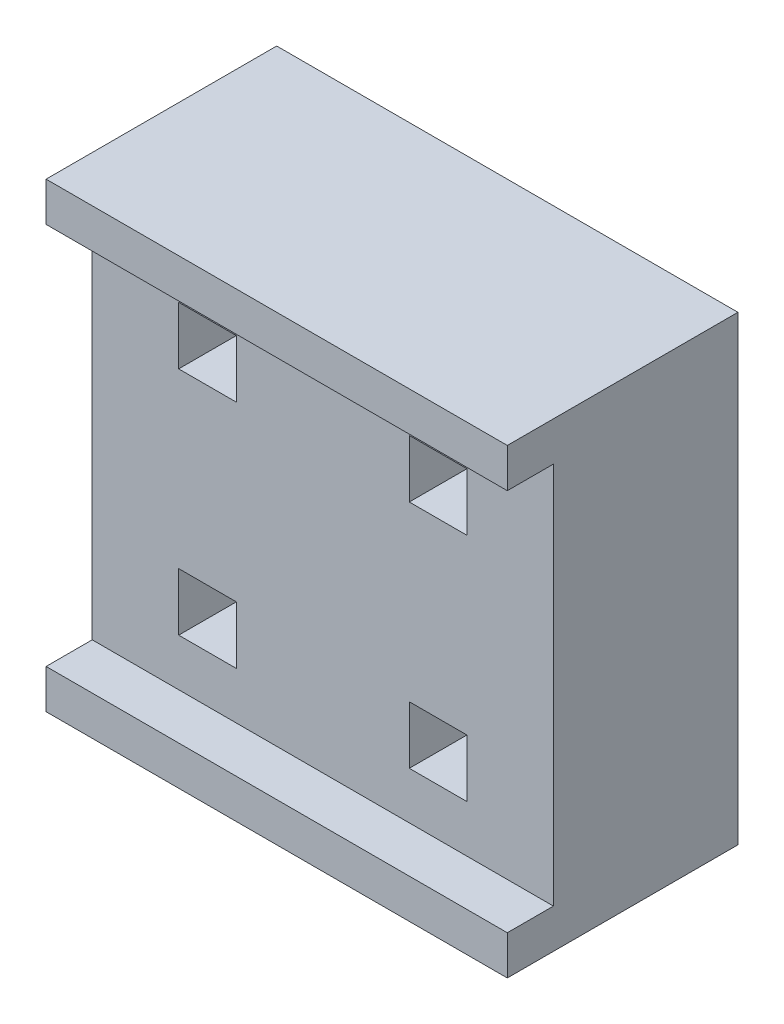
ISO-10303-21;
HEADER;
FILE_DESCRIPTION(('STEP AP214'),'2;1');
FILE_NAME('part.step','',(''),(''),'','','');
FILE_SCHEMA(('AUTOMOTIVE_DESIGN { 1 0 10303 214 1 1 1 1 }'));
ENDSEC;
DATA;
#1=APPLICATION_CONTEXT('core data for automotive mechanical design processes');
#2=APPLICATION_PROTOCOL_DEFINITION('international standard','automotive_design',2000,#1);
#3=PRODUCT_CONTEXT('',#1,'mechanical');
#4=PRODUCT('Part','Part','',(#3));
#5=PRODUCT_RELATED_PRODUCT_CATEGORY('part','',(#4));
#6=PRODUCT_DEFINITION_FORMATION('','',#4);
#7=PRODUCT_DEFINITION_CONTEXT('part definition',#1,'design');
#8=PRODUCT_DEFINITION('design','',#6,#7);
#9=PRODUCT_DEFINITION_SHAPE('','',#8);
#10=(LENGTH_UNIT() NAMED_UNIT(*) SI_UNIT(.MILLI.,.METRE.));
#11=(NAMED_UNIT(*) PLANE_ANGLE_UNIT() SI_UNIT($,.RADIAN.));
#12=(NAMED_UNIT(*) SI_UNIT($,.STERADIAN.) SOLID_ANGLE_UNIT());
#13=UNCERTAINTY_MEASURE_WITH_UNIT(LENGTH_MEASURE(1.E-05),#10,'distance_accuracy_value','');
#14=(GEOMETRIC_REPRESENTATION_CONTEXT(3) GLOBAL_UNCERTAINTY_ASSIGNED_CONTEXT((#13)) GLOBAL_UNIT_ASSIGNED_CONTEXT((#10,
#11,#12)) REPRESENTATION_CONTEXT('',''));
#15=CARTESIAN_POINT('',(0.,0.,0.));
#16=DIRECTION('',(0.,0.,1.));
#17=DIRECTION('',(1.,0.,0.));
#18=AXIS2_PLACEMENT_3D('',#15,#16,#17);
#19=CARTESIAN_POINT('',(0.000124023441458121,0.000123801387605624,6.33));
#20=DIRECTION('',(0.,-4.37113882867379E-08,1.));
#21=DIRECTION('',(0.,-1.,-4.37113882867379E-08));
#22=AXIS2_PLACEMENT_3D('',#19,#20,#21);
#23=PLANE('',#22);
#24=DIRECTION('',(1.,0.,0.));
#25=VECTOR('',#24,1.);
#26=CARTESIAN_POINT('',(-2.53987597655854,-2.10807619861239,6.32999990784765));
#27=LINE('',#26,#25);
#28=CARTESIAN_POINT('',(-2.53987597655854,-2.10807619861239,6.32999990784765));
#29=VERTEX_POINT('',#28);
#30=CARTESIAN_POINT('',(2.54012402344146,-2.10807619861239,6.32999990784765));
#31=VERTEX_POINT('',#30);
#32=EDGE_CURVE('E11',#29,#31,#27,.T.);
#33=ORIENTED_EDGE('',*,*,#32,.F.);
#34=DIRECTION('',(0.,-0.999999999999999,-4.37113882735736E-08));
#35=VECTOR('',#34,1.);
#36=CARTESIAN_POINT('',(-2.53987597655854,-2.1080761986124,6.32999990784765));
#37=LINE('',#36,#35);
#38=CARTESIAN_POINT('',(-2.53987597655854,-2.53987619861239,6.32999988897307));
#39=VERTEX_POINT('',#38);
#40=EDGE_CURVE('E368',#29,#39,#37,.T.);
#41=ORIENTED_EDGE('',*,*,#40,.T.);
#42=DIRECTION('',(1.,0.,0.));
#43=VECTOR('',#42,1.);
#44=CARTESIAN_POINT('',(-2.53987597655854,-2.53987619861239,6.32999988897307));
#45=LINE('',#44,#43);
#46=CARTESIAN_POINT('',(2.54012402344146,-2.53987619861239,6.32999988897307));
#47=VERTEX_POINT('',#46);
#48=EDGE_CURVE('E366',#39,#47,#45,.T.);
#49=ORIENTED_EDGE('',*,*,#48,.T.);
#50=DIRECTION('',(0.,0.999999999999999,4.37113882735736E-08));
#51=VECTOR('',#50,1.);
#52=CARTESIAN_POINT('',(2.54012402344146,-2.53987619861239,6.32999988897307));
#53=LINE('',#52,#51);
#54=EDGE_CURVE('E354',#47,#31,#53,.T.);
#55=ORIENTED_EDGE('',*,*,#54,.T.);
#56=EDGE_LOOP('',(#33,#41,#49,#55));
#57=FACE_BOUND('',#56,.T.);
#58=ADVANCED_FACE('F17',(#57),#23,.T.);
#59=CARTESIAN_POINT('',(-2.53987597655854,2.54012391241453,3.79000011102693));
#60=DIRECTION('',(-1.,0.,0.));
#61=DIRECTION('',(0.,-1.,-4.37113882867379E-08));
#62=AXIS2_PLACEMENT_3D('',#59,#60,#61);
#63=PLANE('',#62);
#64=DIRECTION('',(0.,4.37113897134182E-08,-0.999999999999999));
#65=VECTOR('',#64,1.);
#66=CARTESIAN_POINT('',(-2.53987597655854,-2.10807619861239,6.32999990784765));
#67=LINE('',#66,#65);
#68=CARTESIAN_POINT('',(-2.53987597655854,-2.10807617640701,5.82199990784765));
#69=VERTEX_POINT('',#68);
#70=EDGE_CURVE('E24',#29,#69,#67,.T.);
#71=ORIENTED_EDGE('',*,*,#70,.T.);
#72=DIRECTION('',(0.,0.999999999999999,4.37113881124894E-08));
#73=VECTOR('',#72,1.);
#74=CARTESIAN_POINT('',(-2.53987597655854,-2.10807617640701,5.82199990784765));
#75=LINE('',#74,#73);
#76=CARTESIAN_POINT('',(-2.53987597655854,2.10832382359299,5.82200009215235));
#77=VERTEX_POINT('',#76);
#78=EDGE_CURVE('E364',#69,#77,#75,.T.);
#79=ORIENTED_EDGE('',*,*,#78,.T.);
#80=DIRECTION('',(0.,-4.37113888392268E-08,0.999999999999999));
#81=VECTOR('',#80,1.);
#82=CARTESIAN_POINT('',(-2.53987597655854,2.10832382359299,5.82200009215235));
#83=LINE('',#82,#81);
#84=CARTESIAN_POINT('',(-2.53987597655854,2.10832380138761,6.33000009215235));
#85=VERTEX_POINT('',#84);
#86=EDGE_CURVE('E356',#77,#85,#83,.T.);
#87=ORIENTED_EDGE('',*,*,#86,.T.);
#88=DIRECTION('',(0.,-0.999999999999999,-4.37113882735736E-08));
#89=VECTOR('',#88,1.);
#90=CARTESIAN_POINT('',(-2.53987597655854,2.54012380138761,6.33000011102693));
#91=LINE('',#90,#89);
#92=CARTESIAN_POINT('',(-2.53987597655854,2.54012380138761,6.33000011102693));
#93=VERTEX_POINT('',#92);
#94=EDGE_CURVE('E347',#93,#85,#91,.T.);
#95=ORIENTED_EDGE('',*,*,#94,.F.);
#96=DIRECTION('',(0.,-4.3711388314712E-08,0.999999999999999));
#97=VECTOR('',#96,1.);
#98=CARTESIAN_POINT('',(-2.53987597655854,2.54012391241453,3.79000011102693));
#99=LINE('',#98,#97);
#100=CARTESIAN_POINT('',(-2.53987597655854,2.54012391241453,3.79000011102693));
#101=VERTEX_POINT('',#100);
#102=EDGE_CURVE('E337',#101,#93,#99,.T.);
#103=ORIENTED_EDGE('',*,*,#102,.F.);
#104=DIRECTION('',(0.,-0.999999999999999,-4.37113884895503E-08));
#105=VECTOR('',#104,1.);
#106=CARTESIAN_POINT('',(-2.53987597655854,2.54012391241453,3.79000011102693));
#107=LINE('',#106,#105);
#108=CARTESIAN_POINT('',(-2.53987597655854,-2.53987608758547,3.78999988897307));
#109=VERTEX_POINT('',#108);
#110=EDGE_CURVE('E324',#101,#109,#107,.T.);
#111=ORIENTED_EDGE('',*,*,#110,.T.);
#112=DIRECTION('',(0.,-4.3711388314712E-08,0.999999999999999));
#113=VECTOR('',#112,1.);
#114=CARTESIAN_POINT('',(-2.53987597655854,-2.53987608758547,3.78999988897307));
#115=LINE('',#114,#113);
#116=EDGE_CURVE('E358',#109,#39,#115,.T.);
#117=ORIENTED_EDGE('',*,*,#116,.T.);
#118=ORIENTED_EDGE('',*,*,#40,.F.);
#119=EDGE_LOOP('',(#71,#79,#87,#95,#103,#111,#117,#118));
#120=FACE_BOUND('',#119,.T.);
#121=ADVANCED_FACE('F374',(#120),#63,.T.);
#122=CARTESIAN_POINT('',(-2.53987597655854,-2.53987608758547,3.78999988897307));
#123=DIRECTION('',(0.,-1.,-4.37113882867379E-08));
#124=DIRECTION('',(1.,0.,0.));
#125=AXIS2_PLACEMENT_3D('',#122,#123,#124);
#126=PLANE('',#125);
#127=ORIENTED_EDGE('',*,*,#48,.F.);
#128=ORIENTED_EDGE('',*,*,#116,.F.);
#129=DIRECTION('',(1.,0.,0.));
#130=VECTOR('',#129,1.);
#131=CARTESIAN_POINT('',(-2.53987597655854,-2.53987608758547,3.78999988897307));
#132=LINE('',#131,#130);
#133=CARTESIAN_POINT('',(2.54012402344146,-2.53987608758547,3.78999988897307));
#134=VERTEX_POINT('',#133);
#135=EDGE_CURVE('E350',#109,#134,#132,.T.);
#136=ORIENTED_EDGE('',*,*,#135,.T.);
#137=DIRECTION('',(0.,-4.3711388314712E-08,0.999999999999999));
#138=VECTOR('',#137,1.);
#139=CARTESIAN_POINT('',(2.54012402344146,-2.53987608758547,3.78999988897307));
#140=LINE('',#139,#138);
#141=EDGE_CURVE('E340',#134,#47,#140,.T.);
#142=ORIENTED_EDGE('',*,*,#141,.T.);
#143=EDGE_LOOP('',(#127,#128,#136,#142));
#144=FACE_BOUND('',#143,.T.);
#145=ADVANCED_FACE('F372',(#144),#126,.T.);
#146=CARTESIAN_POINT('',(2.54012402344146,-2.53987608758547,3.78999988897307));
#147=DIRECTION('',(1.,0.,0.));
#148=DIRECTION('',(0.,1.,4.37113882867379E-08));
#149=AXIS2_PLACEMENT_3D('',#146,#147,#148);
#150=PLANE('',#149);
#151=DIRECTION('',(0.,4.37113897134182E-08,-0.999999999999999));
#152=VECTOR('',#151,1.);
#153=CARTESIAN_POINT('',(2.54012402344146,-2.10807619861239,6.32999990784765));
#154=LINE('',#153,#152);
#155=CARTESIAN_POINT('',(2.54012402344146,-2.10807617640701,5.82199990784765));
#156=VERTEX_POINT('',#155);
#157=EDGE_CURVE('E361',#31,#156,#154,.T.);
#158=ORIENTED_EDGE('',*,*,#157,.F.);
#159=ORIENTED_EDGE('',*,*,#54,.F.);
#160=ORIENTED_EDGE('',*,*,#141,.F.);
#161=DIRECTION('',(0.,0.999999999999999,4.37113881398737E-08));
#162=VECTOR('',#161,1.);
#163=CARTESIAN_POINT('',(2.54012402344146,-2.53987608758547,3.78999988897307));
#164=LINE('',#163,#162);
#165=CARTESIAN_POINT('',(2.54012402344146,2.54012391241453,3.79000011102693));
#166=VERTEX_POINT('',#165);
#167=EDGE_CURVE('E327',#134,#166,#164,.T.);
#168=ORIENTED_EDGE('',*,*,#167,.T.);
#169=DIRECTION('',(0.,-4.3711388314712E-08,0.999999999999999));
#170=VECTOR('',#169,1.);
#171=CARTESIAN_POINT('',(2.54012402344146,2.54012391241453,3.79000011102693));
#172=LINE('',#171,#170);
#173=CARTESIAN_POINT('',(2.54012402344146,2.54012380138761,6.33000011102693));
#174=VERTEX_POINT('',#173);
#175=EDGE_CURVE('E314',#166,#174,#172,.T.);
#176=ORIENTED_EDGE('',*,*,#175,.T.);
#177=DIRECTION('',(0.,0.999999999999999,4.37113882735736E-08));
#178=VECTOR('',#177,1.);
#179=CARTESIAN_POINT('',(2.54012402344146,2.10832380138761,6.33000009215235));
#180=LINE('',#179,#178);
#181=CARTESIAN_POINT('',(2.54012402344146,2.10832380138761,6.33000009215235));
#182=VERTEX_POINT('',#181);
#183=EDGE_CURVE('E304',#182,#174,#180,.T.);
#184=ORIENTED_EDGE('',*,*,#183,.F.);
#185=DIRECTION('',(0.,-4.37113888392268E-08,0.999999999999999));
#186=VECTOR('',#185,1.);
#187=CARTESIAN_POINT('',(2.54012402344146,2.10832382359299,5.82200009215235));
#188=LINE('',#187,#186);
#189=CARTESIAN_POINT('',(2.54012402344146,2.10832382359299,5.82200009215235));
#190=VERTEX_POINT('',#189);
#191=EDGE_CURVE('E290',#190,#182,#188,.T.);
#192=ORIENTED_EDGE('',*,*,#191,.F.);
#193=DIRECTION('',(0.,0.999999999999999,4.37113881124894E-08));
#194=VECTOR('',#193,1.);
#195=CARTESIAN_POINT('',(2.54012402344146,-2.10807617640701,5.82199990784765));
#196=LINE('',#195,#194);
#197=EDGE_CURVE('E279',#156,#190,#196,.T.);
#198=ORIENTED_EDGE('',*,*,#197,.F.);
#199=EDGE_LOOP('',(#158,#159,#160,#168,#176,#184,#192,#198));
#200=FACE_BOUND('',#199,.T.);
#201=ADVANCED_FACE('F382',(#200),#150,.T.);
#202=CARTESIAN_POINT('',(0.952624023441458,1.58762391241453,3.79000006939183));
#203=DIRECTION('',(-1.,0.,0.));
#204=DIRECTION('',(0.,-1.,-4.37113882867379E-08));
#205=AXIS2_PLACEMENT_3D('',#202,#203,#204);
#206=PLANE('',#205);
#207=DIRECTION('',(0.,-4.37113881835833E-08,0.999999999999999));
#208=VECTOR('',#207,1.);
#209=CARTESIAN_POINT('',(0.952624023441458,1.58762391241453,3.79000006939183));
#210=LINE('',#209,#208);
#211=CARTESIAN_POINT('',(0.952624023441458,1.58762391241453,3.79000006939183));
#212=VERTEX_POINT('',#211);
#213=CARTESIAN_POINT('',(0.952624023441458,1.58762382359299,5.82200006939183));
#214=VERTEX_POINT('',#213);
#215=EDGE_CURVE('E352',#212,#214,#210,.T.);
#216=ORIENTED_EDGE('',*,*,#215,.T.);
#217=DIRECTION('',(0.,-0.999999999999999,-4.37113890140651E-08));
#218=VECTOR('',#217,1.);
#219=CARTESIAN_POINT('',(0.952624023441458,1.58762382359299,5.82200006939183));
#220=LINE('',#219,#218);
#221=CARTESIAN_POINT('',(0.952624023441458,0.952623823592991,5.8220000416351));
#222=VERTEX_POINT('',#221);
#223=EDGE_CURVE('E343',#214,#222,#220,.T.);
#224=ORIENTED_EDGE('',*,*,#223,.T.);
#225=DIRECTION('',(0.,-4.37113882928572E-08,0.999999999999999));
#226=VECTOR('',#225,1.);
#227=CARTESIAN_POINT('',(0.952624023441458,0.952623912414532,3.7900000416351));
#228=LINE('',#227,#226);
#229=CARTESIAN_POINT('',(0.952624023441458,0.952623912414532,3.7900000416351));
#230=VERTEX_POINT('',#229);
#231=EDGE_CURVE('E329',#230,#222,#228,.T.);
#232=ORIENTED_EDGE('',*,*,#231,.F.);
#233=DIRECTION('',(0.,-0.999999999999999,-4.3711388314712E-08));
#234=VECTOR('',#233,1.);
#235=CARTESIAN_POINT('',(0.952624023441458,1.58762391241453,3.79000006939183));
#236=LINE('',#235,#234);
#237=EDGE_CURVE('E316',#212,#230,#236,.T.);
#238=ORIENTED_EDGE('',*,*,#237,.F.);
#239=EDGE_LOOP('',(#216,#224,#232,#238));
#240=FACE_BOUND('',#239,.T.);
#241=ADVANCED_FACE('F426',(#240),#206,.F.);
#242=CARTESIAN_POINT('',(1.58762402344146,1.58762391241453,3.79000006939183));
#243=DIRECTION('',(0.,1.,4.37113882867379E-08));
#244=DIRECTION('',(-1.,0.,0.));
#245=AXIS2_PLACEMENT_3D('',#242,#243,#244);
#246=PLANE('',#245);
#247=DIRECTION('',(0.,-4.37113881835833E-08,0.999999999999999));
#248=VECTOR('',#247,1.);
#249=CARTESIAN_POINT('',(1.58762402344146,1.58762391241453,3.79000006939183));
#250=LINE('',#249,#248);
#251=CARTESIAN_POINT('',(1.58762402344146,1.58762391241453,3.79000006939183));
#252=VERTEX_POINT('',#251);
#253=CARTESIAN_POINT('',(1.58762402344146,1.58762382359299,5.82200006939183));
#254=VERTEX_POINT('',#253);
#255=EDGE_CURVE('E345',#252,#254,#250,.T.);
#256=ORIENTED_EDGE('',*,*,#255,.T.);
#257=DIRECTION('',(-1.,0.,0.));
#258=VECTOR('',#257,1.);
#259=CARTESIAN_POINT('',(1.58762402344146,1.58762382359299,5.82200006939183));
#260=LINE('',#259,#258);
#261=EDGE_CURVE('E332',#254,#214,#260,.T.);
#262=ORIENTED_EDGE('',*,*,#261,.T.);
#263=ORIENTED_EDGE('',*,*,#215,.F.);
#264=DIRECTION('',(-1.,0.,0.));
#265=VECTOR('',#264,1.);
#266=CARTESIAN_POINT('',(1.58762402344146,1.58762391241453,3.79000006939183));
#267=LINE('',#266,#265);
#268=EDGE_CURVE('E307',#252,#212,#267,.T.);
#269=ORIENTED_EDGE('',*,*,#268,.F.);
#270=EDGE_LOOP('',(#256,#262,#263,#269));
#271=FACE_BOUND('',#270,.T.);
#272=ADVANCED_FACE('F431',(#271),#246,.F.);
#273=CARTESIAN_POINT('',(1.58762402344146,0.952623912414532,3.7900000416351));
#274=DIRECTION('',(1.,0.,0.));
#275=DIRECTION('',(0.,1.,4.37113882867379E-08));
#276=AXIS2_PLACEMENT_3D('',#273,#274,#275);
#277=PLANE('',#276);
#278=DIRECTION('',(0.,-4.37113882928572E-08,0.999999999999999));
#279=VECTOR('',#278,1.);
#280=CARTESIAN_POINT('',(1.58762402344146,0.952623912414532,3.7900000416351));
#281=LINE('',#280,#279);
#282=CARTESIAN_POINT('',(1.58762402344146,0.952623912414532,3.7900000416351));
#283=VERTEX_POINT('',#282);
#284=CARTESIAN_POINT('',(1.58762402344146,0.952623823592991,5.8220000416351));
#285=VERTEX_POINT('',#284);
#286=EDGE_CURVE('E335',#283,#285,#281,.T.);
#287=ORIENTED_EDGE('',*,*,#286,.T.);
#288=DIRECTION('',(0.,0.999999999999999,4.37113890140651E-08));
#289=VECTOR('',#288,1.);
#290=CARTESIAN_POINT('',(1.58762402344146,0.952623823592991,5.8220000416351));
#291=LINE('',#290,#289);
#292=EDGE_CURVE('E319',#285,#254,#291,.T.);
#293=ORIENTED_EDGE('',*,*,#292,.T.);
#294=ORIENTED_EDGE('',*,*,#255,.F.);
#295=DIRECTION('',(0.,0.999999999999999,4.3711388314712E-08));
#296=VECTOR('',#295,1.);
#297=CARTESIAN_POINT('',(1.58762402344146,0.952623912414532,3.7900000416351));
#298=LINE('',#297,#296);
#299=EDGE_CURVE('E293',#283,#252,#298,.T.);
#300=ORIENTED_EDGE('',*,*,#299,.F.);
#301=EDGE_LOOP('',(#287,#293,#294,#300));
#302=FACE_BOUND('',#301,.T.);
#303=ADVANCED_FACE('F436',(#302),#277,.F.);
#304=CARTESIAN_POINT('',(0.952624023441458,-0.952376087585468,3.7899999583649));
#305=DIRECTION('',(-1.,0.,0.));
#306=DIRECTION('',(0.,-1.,-4.37113882867379E-08));
#307=AXIS2_PLACEMENT_3D('',#304,#305,#306);
#308=PLANE('',#307);
#309=DIRECTION('',(0.,-4.37113882928572E-08,0.999999999999999));
#310=VECTOR('',#309,1.);
#311=CARTESIAN_POINT('',(0.952624023441458,-0.952376087585468,3.7899999583649));
#312=LINE('',#311,#310);
#313=CARTESIAN_POINT('',(0.952624023441458,-0.952376087585468,3.7899999583649));
#314=VERTEX_POINT('',#313);
#315=CARTESIAN_POINT('',(0.952624023441458,-0.952376176407009,5.8219999583649));
#316=VERTEX_POINT('',#315);
#317=EDGE_CURVE('E322',#314,#316,#312,.T.);
#318=ORIENTED_EDGE('',*,*,#317,.T.);
#319=DIRECTION('',(0.,-0.999999999999999,-4.37113890140651E-08));
#320=VECTOR('',#319,1.);
#321=CARTESIAN_POINT('',(0.952624023441458,-0.952376176407009,5.8219999583649));
#322=LINE('',#321,#320);
#323=CARTESIAN_POINT('',(0.952624023441458,-1.58737617640701,5.82199993060817));
#324=VERTEX_POINT('',#323);
#325=EDGE_CURVE('E310',#316,#324,#322,.T.);
#326=ORIENTED_EDGE('',*,*,#325,.T.);
#327=DIRECTION('',(0.,-4.37113884021311E-08,0.999999999999999));
#328=VECTOR('',#327,1.);
#329=CARTESIAN_POINT('',(0.952624023441458,-1.58737608758547,3.78999993060817));
#330=LINE('',#329,#328);
#331=CARTESIAN_POINT('',(0.952624023441458,-1.58737608758547,3.78999993060817));
#332=VERTEX_POINT('',#331);
#333=EDGE_CURVE('E296',#332,#324,#330,.T.);
#334=ORIENTED_EDGE('',*,*,#333,.F.);
#335=DIRECTION('',(0.,-0.999999999999999,-4.3711388314712E-08));
#336=VECTOR('',#335,1.);
#337=CARTESIAN_POINT('',(0.952624023441458,-0.952376087585468,3.7899999583649));
#338=LINE('',#337,#336);
#339=EDGE_CURVE('E282',#314,#332,#338,.T.);
#340=ORIENTED_EDGE('',*,*,#339,.F.);
#341=EDGE_LOOP('',(#318,#326,#334,#340));
#342=FACE_BOUND('',#341,.T.);
#343=ADVANCED_FACE('F441',(#342),#308,.F.);
#344=CARTESIAN_POINT('',(1.58762402344146,-0.952376087585468,3.7899999583649));
#345=DIRECTION('',(0.,1.,4.37113882867379E-08));
#346=DIRECTION('',(-1.,0.,0.));
#347=AXIS2_PLACEMENT_3D('',#344,#345,#346);
#348=PLANE('',#347);
#349=DIRECTION('',(0.,-4.37113882928572E-08,0.999999999999999));
#350=VECTOR('',#349,1.);
#351=CARTESIAN_POINT('',(1.58762402344146,-0.952376087585468,3.7899999583649));
#352=LINE('',#351,#350);
#353=CARTESIAN_POINT('',(1.58762402344146,-0.952376087585468,3.7899999583649));
#354=VERTEX_POINT('',#353);
#355=CARTESIAN_POINT('',(1.58762402344146,-0.952376176407009,5.8219999583649));
#356=VERTEX_POINT('',#355);
#357=EDGE_CURVE('E312',#354,#356,#352,.T.);
#358=ORIENTED_EDGE('',*,*,#357,.T.);
#359=DIRECTION('',(-1.,0.,0.));
#360=VECTOR('',#359,1.);
#361=CARTESIAN_POINT('',(1.58762402344146,-0.952376176407009,5.8219999583649));
#362=LINE('',#361,#360);
#363=EDGE_CURVE('E299',#356,#316,#362,.T.);
#364=ORIENTED_EDGE('',*,*,#363,.T.);
#365=ORIENTED_EDGE('',*,*,#317,.F.);
#366=DIRECTION('',(-1.,0.,0.));
#367=VECTOR('',#366,1.);
#368=CARTESIAN_POINT('',(1.58762402344146,-0.952376087585468,3.7899999583649));
#369=LINE('',#368,#367);
#370=EDGE_CURVE('E272',#354,#314,#369,.T.);
#371=ORIENTED_EDGE('',*,*,#370,.F.);
#372=EDGE_LOOP('',(#358,#364,#365,#371));
#373=FACE_BOUND('',#372,.T.);
#374=ADVANCED_FACE('F446',(#373),#348,.F.);
#375=CARTESIAN_POINT('',(1.58762402344146,-1.58737608758547,3.78999993060817));
#376=DIRECTION('',(1.,0.,0.));
#377=DIRECTION('',(0.,1.,4.37113882867379E-08));
#378=AXIS2_PLACEMENT_3D('',#375,#376,#377);
#379=PLANE('',#378);
#380=DIRECTION('',(0.,-4.37113884021311E-08,0.999999999999999));
#381=VECTOR('',#380,1.);
#382=CARTESIAN_POINT('',(1.58762402344146,-1.58737608758547,3.78999993060817));
#383=LINE('',#382,#381);
#384=CARTESIAN_POINT('',(1.58762402344146,-1.58737608758547,3.78999993060817));
#385=VERTEX_POINT('',#384);
#386=CARTESIAN_POINT('',(1.58762402344146,-1.58737617640701,5.82199993060817));
#387=VERTEX_POINT('',#386);
#388=EDGE_CURVE('E302',#385,#387,#383,.T.);
#389=ORIENTED_EDGE('',*,*,#388,.T.);
#390=DIRECTION('',(0.,0.999999999999999,4.37113890140651E-08));
#391=VECTOR('',#390,1.);
#392=CARTESIAN_POINT('',(1.58762402344146,-1.58737617640701,5.82199993060817));
#393=LINE('',#392,#391);
#394=EDGE_CURVE('E285',#387,#356,#393,.T.);
#395=ORIENTED_EDGE('',*,*,#394,.T.);
#396=ORIENTED_EDGE('',*,*,#357,.F.);
#397=DIRECTION('',(0.,0.999999999999999,4.3711388314712E-08));
#398=VECTOR('',#397,1.);
#399=CARTESIAN_POINT('',(1.58762402344146,-1.58737608758547,3.78999993060817));
#400=LINE('',#399,#398);
#401=EDGE_CURVE('E261',#385,#354,#400,.T.);
#402=ORIENTED_EDGE('',*,*,#401,.F.);
#403=EDGE_LOOP('',(#389,#395,#396,#402));
#404=FACE_BOUND('',#403,.T.);
#405=ADVANCED_FACE('F474',(#404),#379,.F.);
#406=CARTESIAN_POINT('',(-1.58737597655854,1.58762391241453,3.79000006939183));
#407=DIRECTION('',(-1.,0.,0.));
#408=DIRECTION('',(0.,-1.,-4.37113882867379E-08));
#409=AXIS2_PLACEMENT_3D('',#406,#407,#408);
#410=PLANE('',#409);
#411=DIRECTION('',(0.,-4.37113881835833E-08,0.999999999999999));
#412=VECTOR('',#411,1.);
#413=CARTESIAN_POINT('',(-1.58737597655854,1.58762391241453,3.79000006939183));
#414=LINE('',#413,#412);
#415=CARTESIAN_POINT('',(-1.58737597655854,1.58762391241453,3.79000006939183));
#416=VERTEX_POINT('',#415);
#417=CARTESIAN_POINT('',(-1.58737597655854,1.58762382359299,5.82200006939183));
#418=VERTEX_POINT('',#417);
#419=EDGE_CURVE('E288',#416,#418,#414,.T.);
#420=ORIENTED_EDGE('',*,*,#419,.T.);
#421=DIRECTION('',(0.,-0.999999999999999,-4.37113890140651E-08));
#422=VECTOR('',#421,1.);
#423=CARTESIAN_POINT('',(-1.58737597655854,1.58762382359299,5.82200006939183));
#424=LINE('',#423,#422);
#425=CARTESIAN_POINT('',(-1.58737597655854,0.952623823592991,5.8220000416351));
#426=VERTEX_POINT('',#425);
#427=EDGE_CURVE('E275',#418,#426,#424,.T.);
#428=ORIENTED_EDGE('',*,*,#427,.T.);
#429=DIRECTION('',(0.,-4.37113882928572E-08,0.999999999999999));
#430=VECTOR('',#429,1.);
#431=CARTESIAN_POINT('',(-1.58737597655854,0.952623912414532,3.7900000416351));
#432=LINE('',#431,#430);
#433=CARTESIAN_POINT('',(-1.58737597655854,0.952623912414532,3.7900000416351));
#434=VERTEX_POINT('',#433);
#435=EDGE_CURVE('E264',#434,#426,#432,.T.);
#436=ORIENTED_EDGE('',*,*,#435,.F.);
#437=DIRECTION('',(0.,-0.999999999999999,-4.3711388314712E-08));
#438=VECTOR('',#437,1.);
#439=CARTESIAN_POINT('',(-1.58737597655854,1.58762391241453,3.79000006939183));
#440=LINE('',#439,#438);
#441=EDGE_CURVE('E253',#416,#434,#440,.T.);
#442=ORIENTED_EDGE('',*,*,#441,.F.);
#443=EDGE_LOOP('',(#420,#428,#436,#442));
#444=FACE_BOUND('',#443,.T.);
#445=ADVANCED_FACE('F478',(#444),#410,.F.);
#446=CARTESIAN_POINT('',(-0.952375976558542,1.58762391241453,3.79000006939183));
#447=DIRECTION('',(0.,1.,4.37113882867379E-08));
#448=DIRECTION('',(-1.,0.,0.));
#449=AXIS2_PLACEMENT_3D('',#446,#447,#448);
#450=PLANE('',#449);
#451=DIRECTION('',(0.,-4.37113881835833E-08,0.999999999999999));
#452=VECTOR('',#451,1.);
#453=CARTESIAN_POINT('',(-0.952375976558542,1.58762391241453,3.79000006939183));
#454=LINE('',#453,#452);
#455=CARTESIAN_POINT('',(-0.952375976558542,1.58762391241453,3.79000006939183));
#456=VERTEX_POINT('',#455);
#457=CARTESIAN_POINT('',(-0.952375976558542,1.58762382359299,5.82200006939183));
#458=VERTEX_POINT('',#457);
#459=EDGE_CURVE('E277',#456,#458,#454,.T.);
#460=ORIENTED_EDGE('',*,*,#459,.T.);
#461=DIRECTION('',(-1.,0.,0.));
#462=VECTOR('',#461,1.);
#463=CARTESIAN_POINT('',(-0.952375976558542,1.58762382359299,5.82200006939183));
#464=LINE('',#463,#462);
#465=EDGE_CURVE('E267',#458,#418,#464,.T.);
#466=ORIENTED_EDGE('',*,*,#465,.T.);
#467=ORIENTED_EDGE('',*,*,#419,.F.);
#468=DIRECTION('',(-1.,0.,0.));
#469=VECTOR('',#468,1.);
#470=CARTESIAN_POINT('',(-0.952375976558542,1.58762391241453,3.79000006939183));
#471=LINE('',#470,#469);
#472=EDGE_CURVE('E197',#456,#416,#471,.T.);
#473=ORIENTED_EDGE('',*,*,#472,.F.);
#474=EDGE_LOOP('',(#460,#466,#467,#473));
#475=FACE_BOUND('',#474,.T.);
#476=ADVANCED_FACE('F481',(#475),#450,.F.);
#477=CARTESIAN_POINT('',(-0.952375976558542,0.952623912414532,3.7900000416351));
#478=DIRECTION('',(1.,0.,0.));
#479=DIRECTION('',(0.,1.,4.37113882867379E-08));
#480=AXIS2_PLACEMENT_3D('',#477,#478,#479);
#481=PLANE('',#480);
#482=DIRECTION('',(0.,-4.37113882928572E-08,0.999999999999999));
#483=VECTOR('',#482,1.);
#484=CARTESIAN_POINT('',(-0.952375976558542,0.952623912414532,3.7900000416351));
#485=LINE('',#484,#483);
#486=CARTESIAN_POINT('',(-0.952375976558542,0.952623912414532,3.7900000416351));
#487=VERTEX_POINT('',#486);
#488=CARTESIAN_POINT('',(-0.952375976558542,0.952623823592991,5.8220000416351));
#489=VERTEX_POINT('',#488);
#490=EDGE_CURVE('E270',#487,#489,#485,.T.);
#491=ORIENTED_EDGE('',*,*,#490,.T.);
#492=DIRECTION('',(0.,0.999999999999999,4.37113890140651E-08));
#493=VECTOR('',#492,1.);
#494=CARTESIAN_POINT('',(-0.952375976558542,0.952623823592991,5.8220000416351));
#495=LINE('',#494,#493);
#496=EDGE_CURVE('E256',#489,#458,#495,.T.);
#497=ORIENTED_EDGE('',*,*,#496,.T.);
#498=ORIENTED_EDGE('',*,*,#459,.F.);
#499=DIRECTION('',(0.,0.999999999999999,4.3711388314712E-08));
#500=VECTOR('',#499,1.);
#501=CARTESIAN_POINT('',(-0.952375976558542,0.952623912414532,3.7900000416351));
#502=LINE('',#501,#500);
#503=EDGE_CURVE('E241',#487,#456,#502,.T.);
#504=ORIENTED_EDGE('',*,*,#503,.F.);
#505=EDGE_LOOP('',(#491,#497,#498,#504));
#506=FACE_BOUND('',#505,.T.);
#507=ADVANCED_FACE('F486',(#506),#481,.F.);
#508=CARTESIAN_POINT('',(-1.58737597655854,-0.952376087585468,3.7899999583649));
#509=DIRECTION('',(-1.,0.,0.));
#510=DIRECTION('',(0.,-1.,-4.37113882867379E-08));
#511=AXIS2_PLACEMENT_3D('',#508,#509,#510);
#512=PLANE('',#511);
#513=DIRECTION('',(0.,-4.37113882928572E-08,0.999999999999999));
#514=VECTOR('',#513,1.);
#515=CARTESIAN_POINT('',(-1.58737597655854,-0.952376087585468,3.7899999583649));
#516=LINE('',#515,#514);
#517=CARTESIAN_POINT('',(-1.58737597655854,-0.952376087585468,3.7899999583649));
#518=VERTEX_POINT('',#517);
#519=CARTESIAN_POINT('',(-1.58737597655854,-0.952376176407009,5.8219999583649));
#520=VERTEX_POINT('',#519);
#521=EDGE_CURVE('E259',#518,#520,#516,.T.);
#522=ORIENTED_EDGE('',*,*,#521,.T.);
#523=DIRECTION('',(0.,-0.999999999999999,-4.37113890140651E-08));
#524=VECTOR('',#523,1.);
#525=CARTESIAN_POINT('',(-1.58737597655854,-0.952376176407009,5.8219999583649));
#526=LINE('',#525,#524);
#527=CARTESIAN_POINT('',(-1.58737597655854,-1.58737617640701,5.82199993060817));
#528=VERTEX_POINT('',#527);
#529=EDGE_CURVE('E250',#520,#528,#526,.T.);
#530=ORIENTED_EDGE('',*,*,#529,.T.);
#531=DIRECTION('',(0.,-4.37113884021311E-08,0.999999999999999));
#532=VECTOR('',#531,1.);
#533=CARTESIAN_POINT('',(-1.58737597655854,-1.58737608758547,3.78999993060817));
#534=LINE('',#533,#532);
#535=CARTESIAN_POINT('',(-1.58737597655854,-1.58737608758547,3.78999993060817));
#536=VERTEX_POINT('',#535);
#537=EDGE_CURVE('E244',#536,#528,#534,.T.);
#538=ORIENTED_EDGE('',*,*,#537,.F.);
#539=DIRECTION('',(0.,-0.999999999999999,-4.3711388314712E-08));
#540=VECTOR('',#539,1.);
#541=CARTESIAN_POINT('',(-1.58737597655854,-0.952376087585468,3.7899999583649));
#542=LINE('',#541,#540);
#543=EDGE_CURVE('E202',#518,#536,#542,.T.);
#544=ORIENTED_EDGE('',*,*,#543,.F.);
#545=EDGE_LOOP('',(#522,#530,#538,#544));
#546=FACE_BOUND('',#545,.T.);
#547=ADVANCED_FACE('F490',(#546),#512,.F.);
#548=CARTESIAN_POINT('',(-0.952375976558542,-0.952376087585468,3.7899999583649));
#549=DIRECTION('',(0.,1.,4.37113882867379E-08));
#550=DIRECTION('',(-1.,0.,0.));
#551=AXIS2_PLACEMENT_3D('',#548,#549,#550);
#552=PLANE('',#551);
#553=DIRECTION('',(0.,-4.37113882928572E-08,0.999999999999999));
#554=VECTOR('',#553,1.);
#555=CARTESIAN_POINT('',(-0.952375976558542,-0.952376087585468,3.7899999583649));
#556=LINE('',#555,#554);
#557=CARTESIAN_POINT('',(-0.952375976558542,-0.952376087585468,3.7899999583649));
#558=VERTEX_POINT('',#557);
#559=CARTESIAN_POINT('',(-0.952375976558542,-0.952376176407009,5.8219999583649));
#560=VERTEX_POINT('',#559);
#561=EDGE_CURVE('E180',#558,#560,#556,.T.);
#562=ORIENTED_EDGE('',*,*,#561,.T.);
#563=DIRECTION('',(-1.,0.,0.));
#564=VECTOR('',#563,1.);
#565=CARTESIAN_POINT('',(-0.952375976558542,-0.952376176407009,5.8219999583649));
#566=LINE('',#565,#564);
#567=EDGE_CURVE('E198',#560,#520,#566,.T.);
#568=ORIENTED_EDGE('',*,*,#567,.T.);
#569=ORIENTED_EDGE('',*,*,#521,.F.);
#570=DIRECTION('',(-1.,0.,0.));
#571=VECTOR('',#570,1.);
#572=CARTESIAN_POINT('',(-0.952375976558542,-0.952376087585468,3.7899999583649));
#573=LINE('',#572,#571);
#574=EDGE_CURVE('E233',#558,#518,#573,.T.);
#575=ORIENTED_EDGE('',*,*,#574,.F.);
#576=EDGE_LOOP('',(#562,#568,#569,#575));
#577=FACE_BOUND('',#576,.T.);
#578=ADVANCED_FACE('F469',(#577),#552,.F.);
#579=CARTESIAN_POINT('',(-0.952375976558542,-1.58737608758547,3.78999993060817));
#580=DIRECTION('',(1.,0.,0.));
#581=DIRECTION('',(0.,1.,4.37113882867379E-08));
#582=AXIS2_PLACEMENT_3D('',#579,#580,#581);
#583=PLANE('',#582);
#584=DIRECTION('',(0.,-4.37113884021311E-08,0.999999999999999));
#585=VECTOR('',#584,1.);
#586=CARTESIAN_POINT('',(-0.952375976558542,-1.58737608758547,3.78999993060817));
#587=LINE('',#586,#585);
#588=CARTESIAN_POINT('',(-0.952375976558542,-1.58737608758547,3.78999993060817));
#589=VERTEX_POINT('',#588);
#590=CARTESIAN_POINT('',(-0.952375976558542,-1.58737617640701,5.82199993060817));
#591=VERTEX_POINT('',#590);
#592=EDGE_CURVE('E178',#589,#591,#587,.T.);
#593=ORIENTED_EDGE('',*,*,#592,.T.);
#594=DIRECTION('',(0.,0.999999999999999,4.37113890140651E-08));
#595=VECTOR('',#594,1.);
#596=CARTESIAN_POINT('',(-0.952375976558542,-1.58737617640701,5.82199993060817));
#597=LINE('',#596,#595);
#598=EDGE_CURVE('E239',#591,#560,#597,.T.);
#599=ORIENTED_EDGE('',*,*,#598,.T.);
#600=ORIENTED_EDGE('',*,*,#561,.F.);
#601=DIRECTION('',(0.,0.999999999999999,4.3711388314712E-08));
#602=VECTOR('',#601,1.);
#603=CARTESIAN_POINT('',(-0.952375976558542,-1.58737608758547,3.78999993060817));
#604=LINE('',#603,#602);
#605=EDGE_CURVE('E174',#589,#558,#604,.T.);
#606=ORIENTED_EDGE('',*,*,#605,.F.);
#607=EDGE_LOOP('',(#593,#599,#600,#606));
#608=FACE_BOUND('',#607,.T.);
#609=ADVANCED_FACE('F176',(#608),#583,.F.);
#610=CARTESIAN_POINT('',(0.952624023441458,0.952623912414532,3.7900000416351));
#611=DIRECTION('',(0.,-1.,-4.37113882867379E-08));
#612=DIRECTION('',(1.,0.,0.));
#613=AXIS2_PLACEMENT_3D('',#610,#611,#612);
#614=PLANE('',#613);
#615=ORIENTED_EDGE('',*,*,#231,.T.);
#616=DIRECTION('',(1.,0.,0.));
#617=VECTOR('',#616,1.);
#618=CARTESIAN_POINT('',(0.952624023441458,0.952623823592991,5.8220000416351));
#619=LINE('',#618,#617);
#620=EDGE_CURVE('E235',#222,#285,#619,.T.);
#621=ORIENTED_EDGE('',*,*,#620,.T.);
#622=ORIENTED_EDGE('',*,*,#286,.F.);
#623=DIRECTION('',(1.,0.,0.));
#624=VECTOR('',#623,1.);
#625=CARTESIAN_POINT('',(0.952624023441458,0.952623912414532,3.7900000416351));
#626=LINE('',#625,#624);
#627=EDGE_CURVE('E226',#230,#283,#626,.T.);
#628=ORIENTED_EDGE('',*,*,#627,.F.);
#629=EDGE_LOOP('',(#615,#621,#622,#628));
#630=FACE_BOUND('',#629,.T.);
#631=ADVANCED_FACE('F454',(#630),#614,.F.);
#632=CARTESIAN_POINT('',(0.952624023441458,-1.58737608758547,3.78999993060817));
#633=DIRECTION('',(0.,-1.,-4.37113882867379E-08));
#634=DIRECTION('',(1.,0.,0.));
#635=AXIS2_PLACEMENT_3D('',#632,#633,#634);
#636=PLANE('',#635);
#637=ORIENTED_EDGE('',*,*,#333,.T.);
#638=DIRECTION('',(1.,0.,0.));
#639=VECTOR('',#638,1.);
#640=CARTESIAN_POINT('',(0.952624023441458,-1.58737617640701,5.82199993060817));
#641=LINE('',#640,#639);
#642=EDGE_CURVE('E185',#324,#387,#641,.T.);
#643=ORIENTED_EDGE('',*,*,#642,.T.);
#644=ORIENTED_EDGE('',*,*,#388,.F.);
#645=DIRECTION('',(1.,0.,0.));
#646=VECTOR('',#645,1.);
#647=CARTESIAN_POINT('',(0.952624023441458,-1.58737608758547,3.78999993060817));
#648=LINE('',#647,#646);
#649=EDGE_CURVE('E219',#332,#385,#648,.T.);
#650=ORIENTED_EDGE('',*,*,#649,.F.);
#651=EDGE_LOOP('',(#637,#643,#644,#650));
#652=FACE_BOUND('',#651,.T.);
#653=ADVANCED_FACE('F461',(#652),#636,.F.);
#654=CARTESIAN_POINT('',(-1.58737597655854,0.952623912414532,3.7900000416351));
#655=DIRECTION('',(0.,-1.,-4.37113882867379E-08));
#656=DIRECTION('',(1.,0.,0.));
#657=AXIS2_PLACEMENT_3D('',#654,#655,#656);
#658=PLANE('',#657);
#659=ORIENTED_EDGE('',*,*,#435,.T.);
#660=DIRECTION('',(1.,0.,0.));
#661=VECTOR('',#660,1.);
#662=CARTESIAN_POINT('',(-1.58737597655854,0.952623823592991,5.8220000416351));
#663=LINE('',#662,#661);
#664=EDGE_CURVE('E186',#426,#489,#663,.T.);
#665=ORIENTED_EDGE('',*,*,#664,.T.);
#666=ORIENTED_EDGE('',*,*,#490,.F.);
#667=DIRECTION('',(1.,0.,0.));
#668=VECTOR('',#667,1.);
#669=CARTESIAN_POINT('',(-1.58737597655854,0.952623912414532,3.7900000416351));
#670=LINE('',#669,#668);
#671=EDGE_CURVE('E216',#434,#487,#670,.T.);
#672=ORIENTED_EDGE('',*,*,#671,.F.);
#673=EDGE_LOOP('',(#659,#665,#666,#672));
#674=FACE_BOUND('',#673,.T.);
#675=ADVANCED_FACE('F409',(#674),#658,.F.);
#676=CARTESIAN_POINT('',(-1.58737597655854,-1.58737608758547,3.78999993060817));
#677=DIRECTION('',(0.,-1.,-4.37113882867379E-08));
#678=DIRECTION('',(1.,0.,0.));
#679=AXIS2_PLACEMENT_3D('',#676,#677,#678);
#680=PLANE('',#679);
#681=ORIENTED_EDGE('',*,*,#537,.T.);
#682=DIRECTION('',(1.,0.,0.));
#683=VECTOR('',#682,1.);
#684=CARTESIAN_POINT('',(-1.58737597655854,-1.58737617640701,5.82199993060817));
#685=LINE('',#684,#683);
#686=EDGE_CURVE('E195',#528,#591,#685,.T.);
#687=ORIENTED_EDGE('',*,*,#686,.T.);
#688=ORIENTED_EDGE('',*,*,#592,.F.);
#689=DIRECTION('',(1.,0.,0.));
#690=VECTOR('',#689,1.);
#691=CARTESIAN_POINT('',(-1.58737597655854,-1.58737608758547,3.78999993060817));
#692=LINE('',#691,#690);
#693=EDGE_CURVE('E192',#536,#589,#692,.T.);
#694=ORIENTED_EDGE('',*,*,#693,.F.);
#695=EDGE_LOOP('',(#681,#687,#688,#694));
#696=FACE_BOUND('',#695,.T.);
#697=ADVANCED_FACE('F191',(#696),#680,.F.);
#698=CARTESIAN_POINT('',(2.54012402344146,2.54012391241453,3.79000011102693));
#699=DIRECTION('',(0.,1.,4.37113882867379E-08));
#700=DIRECTION('',(-1.,0.,0.));
#701=AXIS2_PLACEMENT_3D('',#698,#699,#700);
#702=PLANE('',#701);
#703=DIRECTION('',(-1.,0.,0.));
#704=VECTOR('',#703,1.);
#705=CARTESIAN_POINT('',(2.54012402344146,2.54012380138761,6.33000011102693));
#706=LINE('',#705,#704);
#707=EDGE_CURVE('E223',#174,#93,#706,.T.);
#708=ORIENTED_EDGE('',*,*,#707,.F.);
#709=ORIENTED_EDGE('',*,*,#175,.F.);
#710=DIRECTION('',(-1.,0.,0.));
#711=VECTOR('',#710,1.);
#712=CARTESIAN_POINT('',(2.54012402344146,2.54012391241453,3.79000011102693));
#713=LINE('',#712,#711);
#714=EDGE_CURVE('E203',#166,#101,#713,.T.);
#715=ORIENTED_EDGE('',*,*,#714,.T.);
#716=ORIENTED_EDGE('',*,*,#102,.T.);
#717=EDGE_LOOP('',(#708,#709,#715,#716));
#718=FACE_BOUND('',#717,.T.);
#719=ADVANCED_FACE('F400',(#718),#702,.T.);
#720=CARTESIAN_POINT('',(0.000124023441458121,0.000123912414531873,3.79));
#721=DIRECTION('',(0.,-4.37113882867379E-08,1.));
#722=DIRECTION('',(0.,-1.,-4.37113882867379E-08));
#723=AXIS2_PLACEMENT_3D('',#720,#721,#722);
#724=PLANE('',#723);
#725=ORIENTED_EDGE('',*,*,#110,.F.);
#726=ORIENTED_EDGE('',*,*,#714,.F.);
#727=ORIENTED_EDGE('',*,*,#167,.F.);
#728=ORIENTED_EDGE('',*,*,#135,.F.);
#729=EDGE_LOOP('',(#725,#726,#727,#728));
#730=FACE_BOUND('',#729,.T.);
#731=ORIENTED_EDGE('',*,*,#441,.T.);
#732=ORIENTED_EDGE('',*,*,#671,.T.);
#733=ORIENTED_EDGE('',*,*,#503,.T.);
#734=ORIENTED_EDGE('',*,*,#472,.T.);
#735=EDGE_LOOP('',(#731,#732,#733,#734));
#736=FACE_BOUND('',#735,.T.);
#737=ORIENTED_EDGE('',*,*,#339,.T.);
#738=ORIENTED_EDGE('',*,*,#649,.T.);
#739=ORIENTED_EDGE('',*,*,#401,.T.);
#740=ORIENTED_EDGE('',*,*,#370,.T.);
#741=EDGE_LOOP('',(#737,#738,#739,#740));
#742=FACE_BOUND('',#741,.T.);
#743=ORIENTED_EDGE('',*,*,#237,.T.);
#744=ORIENTED_EDGE('',*,*,#627,.T.);
#745=ORIENTED_EDGE('',*,*,#299,.T.);
#746=ORIENTED_EDGE('',*,*,#268,.T.);
#747=EDGE_LOOP('',(#743,#744,#745,#746));
#748=FACE_BOUND('',#747,.T.);
#749=ORIENTED_EDGE('',*,*,#543,.T.);
#750=ORIENTED_EDGE('',*,*,#693,.T.);
#751=ORIENTED_EDGE('',*,*,#605,.T.);
#752=ORIENTED_EDGE('',*,*,#574,.T.);
#753=EDGE_LOOP('',(#749,#750,#751,#752));
#754=FACE_BOUND('',#753,.T.);
#755=ADVANCED_FACE('F200',(#730,#736,#742,#748,#754),#724,.F.);
#756=CARTESIAN_POINT('',(0.000124023441458121,0.000123801387605624,6.33));
#757=DIRECTION('',(0.,-4.37113882867379E-08,1.));
#758=DIRECTION('',(0.,-1.,-4.37113882867379E-08));
#759=AXIS2_PLACEMENT_3D('',#756,#757,#758);
#760=PLANE('',#759);
#761=DIRECTION('',(1.,0.,0.));
#762=VECTOR('',#761,1.);
#763=CARTESIAN_POINT('',(-2.53987597655854,2.10832380138761,6.33000009215235));
#764=LINE('',#763,#762);
#765=EDGE_CURVE('E207',#85,#182,#764,.T.);
#766=ORIENTED_EDGE('',*,*,#765,.T.);
#767=ORIENTED_EDGE('',*,*,#183,.T.);
#768=ORIENTED_EDGE('',*,*,#707,.T.);
#769=ORIENTED_EDGE('',*,*,#94,.T.);
#770=EDGE_LOOP('',(#766,#767,#768,#769));
#771=FACE_BOUND('',#770,.T.);
#772=ADVANCED_FACE('F396',(#771),#760,.T.);
#773=CARTESIAN_POINT('',(-2.53987597655854,-2.10807617640701,5.82199990784765));
#774=DIRECTION('',(0.,4.37113882867379E-08,-1.));
#775=DIRECTION('',(0.,1.,4.37113882867379E-08));
#776=AXIS2_PLACEMENT_3D('',#773,#774,#775);
#777=PLANE('',#776);
#778=ORIENTED_EDGE('',*,*,#197,.T.);
#779=DIRECTION('',(1.,0.,0.));
#780=VECTOR('',#779,1.);
#781=CARTESIAN_POINT('',(-2.53987597655854,2.10832382359299,5.82200009215235));
#782=LINE('',#781,#780);
#783=EDGE_CURVE('E204',#77,#190,#782,.T.);
#784=ORIENTED_EDGE('',*,*,#783,.F.);
#785=ORIENTED_EDGE('',*,*,#78,.F.);
#786=DIRECTION('',(1.,0.,0.));
#787=VECTOR('',#786,1.);
#788=CARTESIAN_POINT('',(-2.53987597655854,-2.10807617640701,5.82199990784765));
#789=LINE('',#788,#787);
#790=EDGE_CURVE('E210',#69,#156,#789,.T.);
#791=ORIENTED_EDGE('',*,*,#790,.T.);
#792=EDGE_LOOP('',(#778,#784,#785,#791));
#793=FACE_BOUND('',#792,.T.);
#794=ORIENTED_EDGE('',*,*,#567,.F.);
#795=ORIENTED_EDGE('',*,*,#598,.F.);
#796=ORIENTED_EDGE('',*,*,#686,.F.);
#797=ORIENTED_EDGE('',*,*,#529,.F.);
#798=EDGE_LOOP('',(#794,#795,#796,#797));
#799=FACE_BOUND('',#798,.T.);
#800=ORIENTED_EDGE('',*,*,#465,.F.);
#801=ORIENTED_EDGE('',*,*,#496,.F.);
#802=ORIENTED_EDGE('',*,*,#664,.F.);
#803=ORIENTED_EDGE('',*,*,#427,.F.);
#804=EDGE_LOOP('',(#800,#801,#802,#803));
#805=FACE_BOUND('',#804,.T.);
#806=ORIENTED_EDGE('',*,*,#363,.F.);
#807=ORIENTED_EDGE('',*,*,#394,.F.);
#808=ORIENTED_EDGE('',*,*,#642,.F.);
#809=ORIENTED_EDGE('',*,*,#325,.F.);
#810=EDGE_LOOP('',(#806,#807,#808,#809));
#811=FACE_BOUND('',#810,.T.);
#812=ORIENTED_EDGE('',*,*,#261,.F.);
#813=ORIENTED_EDGE('',*,*,#292,.F.);
#814=ORIENTED_EDGE('',*,*,#620,.F.);
#815=ORIENTED_EDGE('',*,*,#223,.F.);
#816=EDGE_LOOP('',(#812,#813,#814,#815));
#817=FACE_BOUND('',#816,.T.);
#818=ADVANCED_FACE('F390',(#793,#799,#805,#811,#817),#777,.F.);
#819=CARTESIAN_POINT('',(-2.53987597655854,-2.10807619861239,6.32999990784765));
#820=DIRECTION('',(0.,-1.,-4.37113891404404E-08));
#821=DIRECTION('',(0.,4.37113891404404E-08,-1.));
#822=AXIS2_PLACEMENT_3D('',#819,#820,#821);
#823=PLANE('',#822);
#824=ORIENTED_EDGE('',*,*,#157,.T.);
#825=ORIENTED_EDGE('',*,*,#790,.F.);
#826=ORIENTED_EDGE('',*,*,#70,.F.);
#827=ORIENTED_EDGE('',*,*,#32,.T.);
#828=EDGE_LOOP('',(#824,#825,#826,#827));
#829=FACE_BOUND('',#828,.T.);
#830=ADVANCED_FACE('F385',(#829),#823,.F.);
#831=CARTESIAN_POINT('',(-2.53987597655854,2.10832382359299,5.82200009215235));
#832=DIRECTION('',(0.,1.,4.37113882867379E-08));
#833=DIRECTION('',(-1.,0.,0.));
#834=AXIS2_PLACEMENT_3D('',#831,#832,#833);
#835=PLANE('',#834);
#836=ORIENTED_EDGE('',*,*,#191,.T.);
#837=ORIENTED_EDGE('',*,*,#765,.F.);
#838=ORIENTED_EDGE('',*,*,#86,.F.);
#839=ORIENTED_EDGE('',*,*,#783,.T.);
#840=EDGE_LOOP('',(#836,#837,#838,#839));
#841=FACE_BOUND('',#840,.T.);
#842=ADVANCED_FACE('F398',(#841),#835,.F.);
#843=CLOSED_SHELL('',(#58,#121,#145,#201,#241,#272,#303,#343,#374,#405,#445,#476,#507,#547,#578,
#609,#631,#653,#675,#697,#719,#755,#772,#818,#830,#842));
#844=MANIFOLD_SOLID_BREP('B1',#843);
#845=ADVANCED_BREP_SHAPE_REPRESENTATION('',(#18,#844),#14);
#846=SHAPE_DEFINITION_REPRESENTATION(#9,#845);
ENDSEC;
END-ISO-10303-21;
